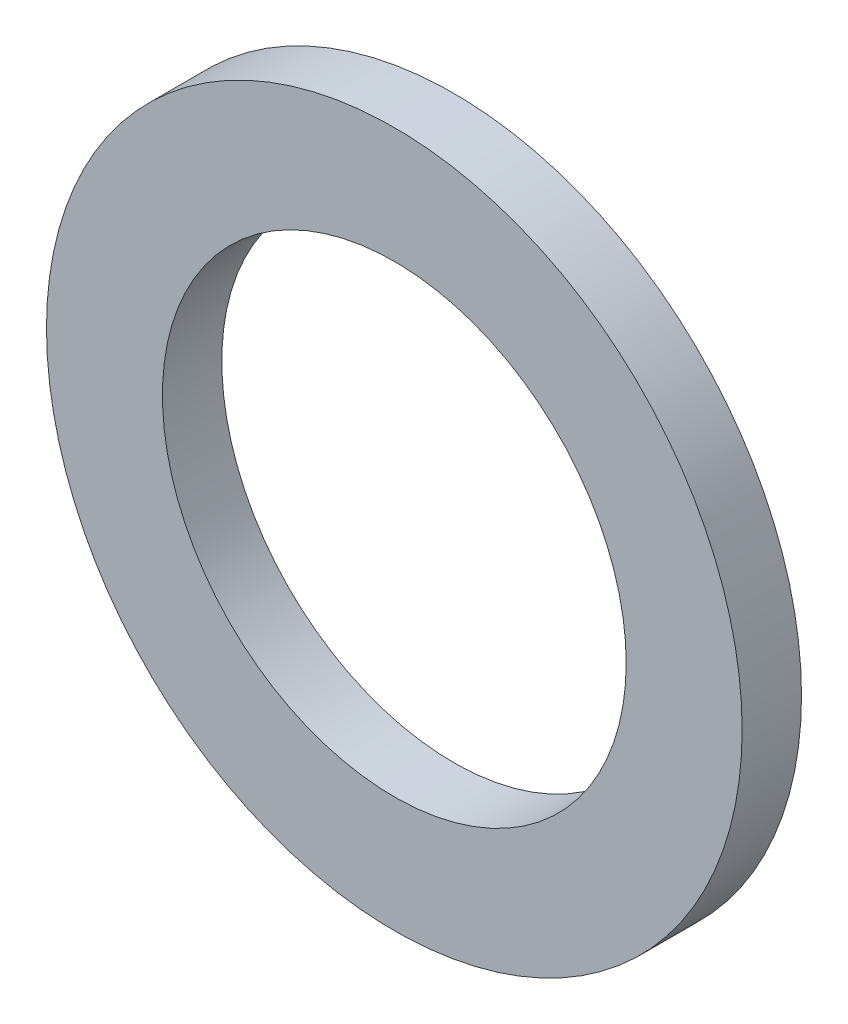
ISO-10303-21;
HEADER;
FILE_DESCRIPTION(('STEP AP214'),'2;1');
FILE_NAME('part.step','',(''),(''),'','','');
FILE_SCHEMA(('AUTOMOTIVE_DESIGN { 1 0 10303 214 1 1 1 1 }'));
ENDSEC;
DATA;
#1=APPLICATION_CONTEXT('core data for automotive mechanical design processes');
#2=APPLICATION_PROTOCOL_DEFINITION('international standard','automotive_design',2000,#1);
#3=PRODUCT_CONTEXT('',#1,'mechanical');
#4=PRODUCT('Part','Part','',(#3));
#5=PRODUCT_RELATED_PRODUCT_CATEGORY('part','',(#4));
#6=PRODUCT_DEFINITION_FORMATION('','',#4);
#7=PRODUCT_DEFINITION_CONTEXT('part definition',#1,'design');
#8=PRODUCT_DEFINITION('design','',#6,#7);
#9=PRODUCT_DEFINITION_SHAPE('','',#8);
#10=(LENGTH_UNIT() NAMED_UNIT(*) SI_UNIT(.MILLI.,.METRE.));
#11=(NAMED_UNIT(*) PLANE_ANGLE_UNIT() SI_UNIT($,.RADIAN.));
#12=(NAMED_UNIT(*) SI_UNIT($,.STERADIAN.) SOLID_ANGLE_UNIT());
#13=UNCERTAINTY_MEASURE_WITH_UNIT(LENGTH_MEASURE(1.E-05),#10,'distance_accuracy_value','');
#14=(GEOMETRIC_REPRESENTATION_CONTEXT(3) GLOBAL_UNCERTAINTY_ASSIGNED_CONTEXT((#13)) GLOBAL_UNIT_ASSIGNED_CONTEXT((#10,
#11,#12)) REPRESENTATION_CONTEXT('',''));
#15=CARTESIAN_POINT('',(0.,0.,0.));
#16=DIRECTION('',(0.,0.,1.));
#17=DIRECTION('',(1.,0.,0.));
#18=AXIS2_PLACEMENT_3D('',#15,#16,#17);
#19=CARTESIAN_POINT('',(0.,0.,0.));
#20=DIRECTION('',(0.,0.,1.));
#21=DIRECTION('',(1.,0.,0.));
#22=AXIS2_PLACEMENT_3D('',#19,#20,#21);
#23=CYLINDRICAL_SURFACE('',#22,1.5875);
#24=CARTESIAN_POINT('',(0.,0.,0.4064));
#25=DIRECTION('',(0.,0.,1.));
#26=DIRECTION('',(1.,0.,0.));
#27=AXIS2_PLACEMENT_3D('',#24,#25,#26);
#28=CIRCLE('',#27,1.5875);
#29=CARTESIAN_POINT('',(1.5875,0.,0.4064));
#30=VERTEX_POINT('',#29);
#31=EDGE_CURVE('E10',#30,#30,#28,.T.);
#32=ORIENTED_EDGE('',*,*,#31,.T.);
#33=EDGE_LOOP('',(#32));
#34=FACE_BOUND('',#33,.T.);
#35=CARTESIAN_POINT('',(0.,0.,0.));
#36=DIRECTION('',(0.,0.,1.));
#37=DIRECTION('',(1.,0.,0.));
#38=AXIS2_PLACEMENT_3D('',#35,#36,#37);
#39=CIRCLE('',#38,1.5875);
#40=CARTESIAN_POINT('',(1.5875,0.,0.));
#41=VERTEX_POINT('',#40);
#42=EDGE_CURVE('E45',#41,#41,#39,.T.);
#43=ORIENTED_EDGE('',*,*,#42,.F.);
#44=EDGE_LOOP('',(#43));
#45=FACE_BOUND('',#44,.T.);
#46=ADVANCED_FACE('F31',(#34,#45),#23,.F.);
#47=CARTESIAN_POINT('',(1.5875,0.,0.4064));
#48=DIRECTION('',(0.,0.,1.));
#49=DIRECTION('',(1.,0.,0.));
#50=AXIS2_PLACEMENT_3D('',#47,#48,#49);
#51=PLANE('',#50);
#52=CARTESIAN_POINT('',(0.,0.,0.4064));
#53=DIRECTION('',(0.,0.,1.));
#54=DIRECTION('',(1.,0.,0.));
#55=AXIS2_PLACEMENT_3D('',#52,#53,#54);
#56=CIRCLE('',#55,2.38125);
#57=CARTESIAN_POINT('',(2.38125,0.,0.4064));
#58=VERTEX_POINT('',#57);
#59=EDGE_CURVE('E37',#58,#58,#56,.T.);
#60=ORIENTED_EDGE('',*,*,#59,.T.);
#61=EDGE_LOOP('',(#60));
#62=FACE_BOUND('',#61,.T.);
#63=ORIENTED_EDGE('',*,*,#31,.F.);
#64=EDGE_LOOP('',(#63));
#65=FACE_BOUND('',#64,.T.);
#66=ADVANCED_FACE('F55',(#62,#65),#51,.T.);
#67=CARTESIAN_POINT('',(0.,0.,0.));
#68=DIRECTION('',(0.,0.,1.));
#69=DIRECTION('',(1.,0.,0.));
#70=AXIS2_PLACEMENT_3D('',#67,#68,#69);
#71=CYLINDRICAL_SURFACE('',#70,2.38125);
#72=CARTESIAN_POINT('',(0.,0.,0.));
#73=DIRECTION('',(0.,0.,1.));
#74=DIRECTION('',(1.,0.,0.));
#75=AXIS2_PLACEMENT_3D('',#72,#73,#74);
#76=CIRCLE('',#75,2.38125);
#77=CARTESIAN_POINT('',(2.38125,0.,0.));
#78=VERTEX_POINT('',#77);
#79=EDGE_CURVE('E41',#78,#78,#76,.T.);
#80=ORIENTED_EDGE('',*,*,#79,.T.);
#81=EDGE_LOOP('',(#80));
#82=FACE_BOUND('',#81,.T.);
#83=ORIENTED_EDGE('',*,*,#59,.F.);
#84=EDGE_LOOP('',(#83));
#85=FACE_BOUND('',#84,.T.);
#86=ADVANCED_FACE('F59',(#82,#85),#71,.T.);
#87=CARTESIAN_POINT('',(2.38125,0.,0.));
#88=DIRECTION('',(0.,0.,-1.));
#89=DIRECTION('',(-1.,0.,0.));
#90=AXIS2_PLACEMENT_3D('',#87,#88,#89);
#91=PLANE('',#90);
#92=ORIENTED_EDGE('',*,*,#42,.T.);
#93=EDGE_LOOP('',(#92));
#94=FACE_BOUND('',#93,.T.);
#95=ORIENTED_EDGE('',*,*,#79,.F.);
#96=EDGE_LOOP('',(#95));
#97=FACE_BOUND('',#96,.T.);
#98=ADVANCED_FACE('F51',(#94,#97),#91,.T.);
#99=CLOSED_SHELL('',(#46,#66,#86,#98));
#100=MANIFOLD_SOLID_BREP('B2',#99);
#101=ADVANCED_BREP_SHAPE_REPRESENTATION('',(#18,#100),#14);
#102=SHAPE_DEFINITION_REPRESENTATION(#9,#101);
ENDSEC;
END-ISO-10303-21;
